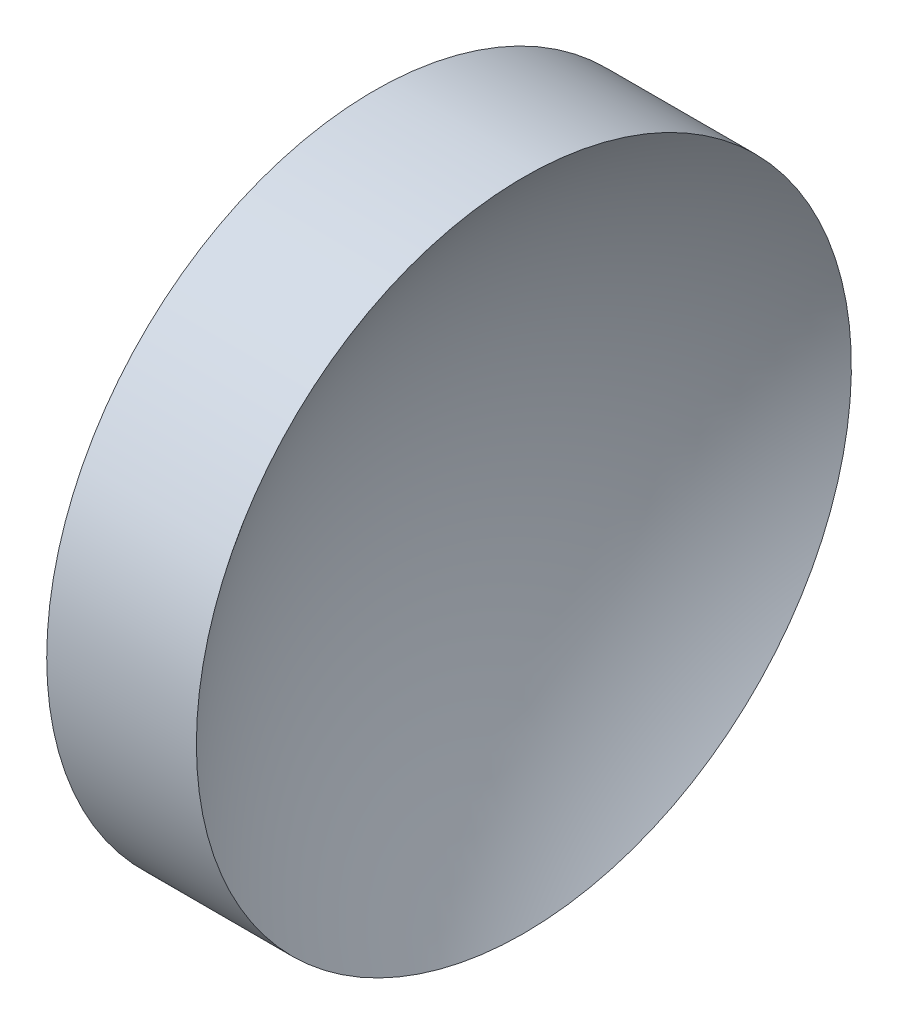
ISO-10303-21;
HEADER;
FILE_DESCRIPTION(('STEP AP214'),'2;1');
FILE_NAME('part.step','',(''),(''),'','','');
FILE_SCHEMA(('AUTOMOTIVE_DESIGN { 1 0 10303 214 1 1 1 1 }'));
ENDSEC;
DATA;
#1=APPLICATION_CONTEXT('core data for automotive mechanical design processes');
#2=APPLICATION_PROTOCOL_DEFINITION('international standard','automotive_design',2000,#1);
#3=PRODUCT_CONTEXT('',#1,'mechanical');
#4=PRODUCT('Part','Part','',(#3));
#5=PRODUCT_RELATED_PRODUCT_CATEGORY('part','',(#4));
#6=PRODUCT_DEFINITION_FORMATION('','',#4);
#7=PRODUCT_DEFINITION_CONTEXT('part definition',#1,'design');
#8=PRODUCT_DEFINITION('design','',#6,#7);
#9=PRODUCT_DEFINITION_SHAPE('','',#8);
#10=(LENGTH_UNIT() NAMED_UNIT(*) SI_UNIT(.MILLI.,.METRE.));
#11=(NAMED_UNIT(*) PLANE_ANGLE_UNIT() SI_UNIT($,.RADIAN.));
#12=(NAMED_UNIT(*) SI_UNIT($,.STERADIAN.) SOLID_ANGLE_UNIT());
#13=UNCERTAINTY_MEASURE_WITH_UNIT(LENGTH_MEASURE(1.E-05),#10,'distance_accuracy_value','');
#14=(GEOMETRIC_REPRESENTATION_CONTEXT(3) GLOBAL_UNCERTAINTY_ASSIGNED_CONTEXT((#13)) GLOBAL_UNIT_ASSIGNED_CONTEXT((#10,
#11,#12)) REPRESENTATION_CONTEXT('',''));
#15=CARTESIAN_POINT('',(0.,0.,0.));
#16=DIRECTION('',(0.,0.,1.));
#17=DIRECTION('',(1.,0.,0.));
#18=AXIS2_PLACEMENT_3D('',#15,#16,#17);
#19=CARTESIAN_POINT('',(158.039437134643,65.1556304570152,0.));
#20=DIRECTION('',(-1.,0.,0.));
#21=DIRECTION('',(0.,-1.,0.));
#22=AXIS2_PLACEMENT_3D('',#19,#20,#21);
#23=SPHERICAL_SURFACE('',#22,41.3);
#24=CARTESIAN_POINT('',(125.165587344879,65.1556304570152,0.));
#25=DIRECTION('',(-1.,0.,0.));
#26=DIRECTION('',(0.,0.,1.));
#27=AXIS2_PLACEMENT_3D('',#24,#25,#26);
#28=CIRCLE('',#27,25.);
#29=CARTESIAN_POINT('',(125.165587344879,65.1556304570152,25.));
#30=VERTEX_POINT('',#29);
#31=EDGE_CURVE('E10',#30,#30,#28,.T.);
#32=ORIENTED_EDGE('',*,*,#31,.F.);
#33=EDGE_LOOP('',(#32));
#34=FACE_BOUND('',#33,.T.);
#35=ADVANCED_FACE('F35',(#34),#23,.F.);
#36=CARTESIAN_POINT('',(105.62183712383,65.1556304570152,0.));
#37=DIRECTION('',(-1.,0.,0.));
#38=DIRECTION('',(0.,0.,1.));
#39=AXIS2_PLACEMENT_3D('',#36,#37,#38);
#40=CYLINDRICAL_SURFACE('',#39,25.);
#41=CARTESIAN_POINT('',(113.739437134643,65.1556304570152,0.));
#42=DIRECTION('',(-1.,0.,0.));
#43=DIRECTION('',(0.,0.,1.));
#44=AXIS2_PLACEMENT_3D('',#41,#42,#43);
#45=CIRCLE('',#44,25.);
#46=CARTESIAN_POINT('',(113.739437134643,65.1556304570152,25.));
#47=VERTEX_POINT('',#46);
#48=EDGE_CURVE('E41',#47,#47,#45,.T.);
#49=ORIENTED_EDGE('',*,*,#48,.F.);
#50=EDGE_LOOP('',(#49));
#51=FACE_BOUND('',#50,.T.);
#52=ORIENTED_EDGE('',*,*,#31,.T.);
#53=EDGE_LOOP('',(#52));
#54=FACE_BOUND('',#53,.T.);
#55=ADVANCED_FACE('F49',(#51,#54),#40,.T.);
#56=CARTESIAN_POINT('',(113.739437134643,65.1556304570152,0.));
#57=DIRECTION('',(1.,0.,0.));
#58=DIRECTION('',(0.,0.,-1.));
#59=AXIS2_PLACEMENT_3D('',#56,#57,#58);
#60=PLANE('',#59);
#61=ORIENTED_EDGE('',*,*,#48,.T.);
#62=EDGE_LOOP('',(#61));
#63=FACE_BOUND('',#62,.T.);
#64=ADVANCED_FACE('F47',(#63),#60,.F.);
#65=CLOSED_SHELL('',(#35,#55,#64));
#66=MANIFOLD_SOLID_BREP('B2',#65);
#67=ADVANCED_BREP_SHAPE_REPRESENTATION('',(#18,#66),#14);
#68=SHAPE_DEFINITION_REPRESENTATION(#9,#67);
ENDSEC;
END-ISO-10303-21;
